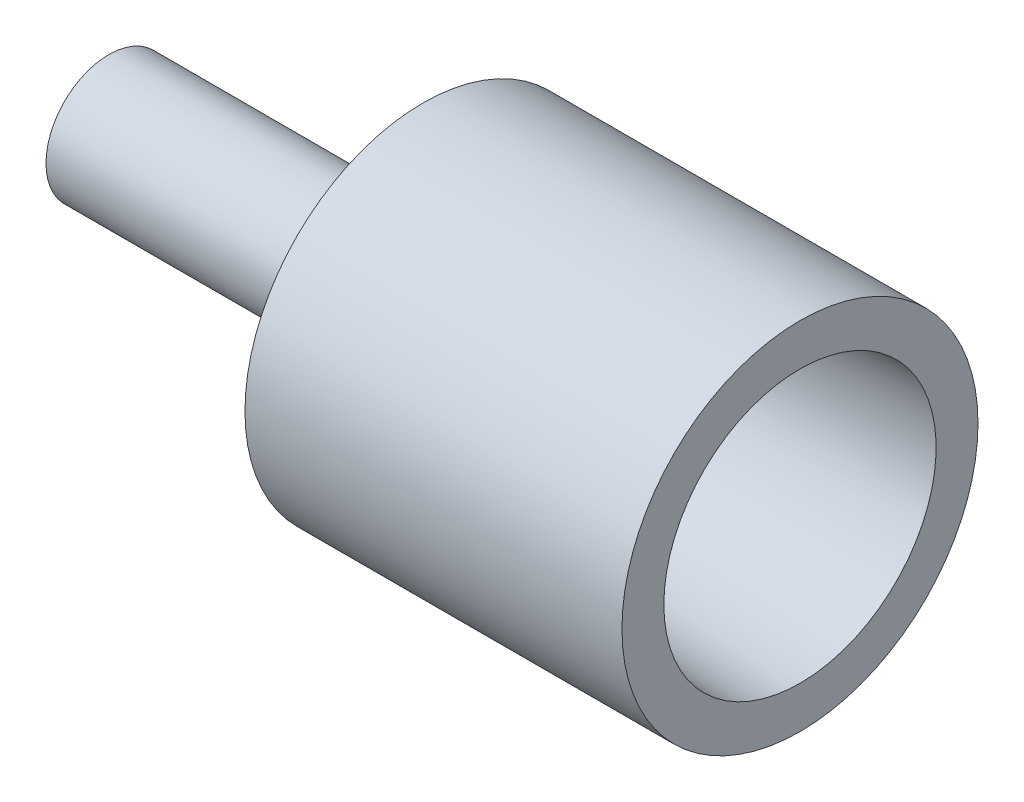
ISO-10303-21;
HEADER;
FILE_DESCRIPTION(('STEP AP214'),'2;1');
FILE_NAME('part.step','',(''),(''),'','','');
FILE_SCHEMA(('AUTOMOTIVE_DESIGN { 1 0 10303 214 1 1 1 1 }'));
ENDSEC;
DATA;
#1=APPLICATION_CONTEXT('core data for automotive mechanical design processes');
#2=APPLICATION_PROTOCOL_DEFINITION('international standard','automotive_design',2000,#1);
#3=PRODUCT_CONTEXT('',#1,'mechanical');
#4=PRODUCT('Part','Part','',(#3));
#5=PRODUCT_RELATED_PRODUCT_CATEGORY('part','',(#4));
#6=PRODUCT_DEFINITION_FORMATION('','',#4);
#7=PRODUCT_DEFINITION_CONTEXT('part definition',#1,'design');
#8=PRODUCT_DEFINITION('design','',#6,#7);
#9=PRODUCT_DEFINITION_SHAPE('','',#8);
#10=(LENGTH_UNIT() NAMED_UNIT(*) SI_UNIT(.MILLI.,.METRE.));
#11=(NAMED_UNIT(*) PLANE_ANGLE_UNIT() SI_UNIT($,.RADIAN.));
#12=(NAMED_UNIT(*) SI_UNIT($,.STERADIAN.) SOLID_ANGLE_UNIT());
#13=UNCERTAINTY_MEASURE_WITH_UNIT(LENGTH_MEASURE(1.E-05),#10,'distance_accuracy_value','');
#14=(GEOMETRIC_REPRESENTATION_CONTEXT(3) GLOBAL_UNCERTAINTY_ASSIGNED_CONTEXT((#13)) GLOBAL_UNIT_ASSIGNED_CONTEXT((#10,
#11,#12)) REPRESENTATION_CONTEXT('',''));
#15=CARTESIAN_POINT('',(0.,0.,0.));
#16=DIRECTION('',(0.,0.,1.));
#17=DIRECTION('',(1.,0.,0.));
#18=AXIS2_PLACEMENT_3D('',#15,#16,#17);
#19=CARTESIAN_POINT('',(15.,0.,-6.5));
#20=DIRECTION('',(-1.,0.,0.));
#21=DIRECTION('',(0.,0.,1.));
#22=AXIS2_PLACEMENT_3D('',#19,#20,#21);
#23=PLANE('',#22);
#24=CARTESIAN_POINT('',(15.,0.,0.));
#25=DIRECTION('',(-1.,0.,0.));
#26=DIRECTION('',(0.,0.,1.));
#27=AXIS2_PLACEMENT_3D('',#24,#25,#26);
#28=CIRCLE('',#27,8.5);
#29=CARTESIAN_POINT('',(15.,0.,8.5));
#30=VERTEX_POINT('',#29);
#31=EDGE_CURVE('E50',#30,#30,#28,.T.);
#32=ORIENTED_EDGE('',*,*,#31,.F.);
#33=EDGE_LOOP('',(#32));
#34=FACE_BOUND('',#33,.T.);
#35=CARTESIAN_POINT('',(15.,0.,0.));
#36=DIRECTION('',(-1.,0.,0.));
#37=DIRECTION('',(0.,0.,1.));
#38=AXIS2_PLACEMENT_3D('',#35,#36,#37);
#39=CIRCLE('',#38,6.5);
#40=CARTESIAN_POINT('',(15.,0.,6.5));
#41=VERTEX_POINT('',#40);
#42=EDGE_CURVE('E69',#41,#41,#39,.T.);
#43=ORIENTED_EDGE('',*,*,#42,.T.);
#44=EDGE_LOOP('',(#43));
#45=FACE_BOUND('',#44,.T.);
#46=ADVANCED_FACE('F37',(#34,#45),#23,.F.);
#47=CARTESIAN_POINT('',(-18.,0.,0.));
#48=DIRECTION('',(-1.,0.,0.));
#49=DIRECTION('',(0.,0.,1.));
#50=AXIS2_PLACEMENT_3D('',#47,#48,#49);
#51=CYLINDRICAL_SURFACE('',#50,8.5);
#52=CARTESIAN_POINT('',(-3.,0.,0.));
#53=DIRECTION('',(-1.,0.,0.));
#54=DIRECTION('',(0.,0.,1.));
#55=AXIS2_PLACEMENT_3D('',#52,#53,#54);
#56=CIRCLE('',#55,8.5);
#57=CARTESIAN_POINT('',(-3.,0.,8.5));
#58=VERTEX_POINT('',#57);
#59=EDGE_CURVE('E56',#58,#58,#56,.T.);
#60=ORIENTED_EDGE('',*,*,#59,.F.);
#61=EDGE_LOOP('',(#60));
#62=FACE_BOUND('',#61,.T.);
#63=ORIENTED_EDGE('',*,*,#31,.T.);
#64=EDGE_LOOP('',(#63));
#65=FACE_BOUND('',#64,.T.);
#66=ADVANCED_FACE('F92',(#62,#65),#51,.T.);
#67=CARTESIAN_POINT('',(-3.,0.,-8.5));
#68=DIRECTION('',(1.,0.,0.));
#69=DIRECTION('',(0.,0.,-1.));
#70=AXIS2_PLACEMENT_3D('',#67,#68,#69);
#71=PLANE('',#70);
#72=CARTESIAN_POINT('',(-3.,0.,0.));
#73=DIRECTION('',(1.,0.,0.));
#74=DIRECTION('',(0.,0.,-1.));
#75=AXIS2_PLACEMENT_3D('',#72,#73,#74);
#76=CIRCLE('',#75,5.99999999999999);
#77=CARTESIAN_POINT('',(-3.,0.,-5.99999999999999));
#78=VERTEX_POINT('',#77);
#79=EDGE_CURVE('E10',#78,#78,#76,.T.);
#80=ORIENTED_EDGE('',*,*,#79,.T.);
#81=EDGE_LOOP('',(#80));
#82=FACE_BOUND('',#81,.T.);
#83=ORIENTED_EDGE('',*,*,#59,.T.);
#84=EDGE_LOOP('',(#83));
#85=FACE_BOUND('',#84,.T.);
#86=ADVANCED_FACE('F97',(#82,#85),#71,.F.);
#87=CARTESIAN_POINT('',(-18.,0.,0.));
#88=DIRECTION('',(-1.,0.,0.));
#89=DIRECTION('',(0.,0.,1.));
#90=AXIS2_PLACEMENT_3D('',#87,#88,#89);
#91=CYLINDRICAL_SURFACE('',#90,3.);
#92=CARTESIAN_POINT('',(-6.00000000000002,0.,0.));
#93=DIRECTION('',(1.,0.,0.));
#94=DIRECTION('',(0.,0.,-1.));
#95=AXIS2_PLACEMENT_3D('',#92,#93,#94);
#96=CIRCLE('',#95,3.);
#97=CARTESIAN_POINT('',(-6.00000000000002,0.,-3.));
#98=VERTEX_POINT('',#97);
#99=EDGE_CURVE('E45',#98,#98,#96,.F.);
#100=ORIENTED_EDGE('',*,*,#99,.T.);
#101=EDGE_LOOP('',(#100));
#102=FACE_BOUND('',#101,.T.);
#103=CARTESIAN_POINT('',(-18.,0.,0.));
#104=DIRECTION('',(-1.,0.,0.));
#105=DIRECTION('',(0.,0.,1.));
#106=AXIS2_PLACEMENT_3D('',#103,#104,#105);
#107=CIRCLE('',#106,3.);
#108=CARTESIAN_POINT('',(-18.,0.,3.));
#109=VERTEX_POINT('',#108);
#110=EDGE_CURVE('E61',#109,#109,#107,.T.);
#111=ORIENTED_EDGE('',*,*,#110,.F.);
#112=EDGE_LOOP('',(#111));
#113=FACE_BOUND('',#112,.T.);
#114=ADVANCED_FACE('F88',(#102,#113),#91,.T.);
#115=CARTESIAN_POINT('',(-18.,0.,-3.));
#116=DIRECTION('',(1.,0.,0.));
#117=DIRECTION('',(0.,0.,-1.));
#118=AXIS2_PLACEMENT_3D('',#115,#116,#117);
#119=PLANE('',#118);
#120=ORIENTED_EDGE('',*,*,#110,.T.);
#121=EDGE_LOOP('',(#120));
#122=FACE_BOUND('',#121,.T.);
#123=ADVANCED_FACE('F83',(#122),#119,.F.);
#124=CARTESIAN_POINT('',(0.,0.,0.));
#125=DIRECTION('',(-1.,0.,0.));
#126=DIRECTION('',(0.,0.,1.));
#127=AXIS2_PLACEMENT_3D('',#124,#125,#126);
#128=PLANE('',#127);
#129=CARTESIAN_POINT('',(0.,0.,0.));
#130=DIRECTION('',(-1.,0.,0.));
#131=DIRECTION('',(0.,0.,1.));
#132=AXIS2_PLACEMENT_3D('',#129,#130,#131);
#133=CIRCLE('',#132,5.75);
#134=CARTESIAN_POINT('',(0.,0.,5.75));
#135=VERTEX_POINT('',#134);
#136=EDGE_CURVE('E65',#135,#135,#133,.T.);
#137=ORIENTED_EDGE('',*,*,#136,.F.);
#138=EDGE_LOOP('',(#137));
#139=FACE_BOUND('',#138,.T.);
#140=ADVANCED_FACE('F78',(#139),#128,.F.);
#141=CARTESIAN_POINT('',(0.,0.,0.));
#142=DIRECTION('',(1.,0.,0.));
#143=DIRECTION('',(0.,0.,-1.));
#144=AXIS2_PLACEMENT_3D('',#141,#142,#143);
#145=CONICAL_SURFACE('',#144,5.75,0.0499583957219427);
#146=ORIENTED_EDGE('',*,*,#42,.F.);
#147=EDGE_LOOP('',(#146));
#148=FACE_BOUND('',#147,.T.);
#149=ORIENTED_EDGE('',*,*,#136,.T.);
#150=EDGE_LOOP('',(#149));
#151=FACE_BOUND('',#150,.T.);
#152=ADVANCED_FACE('F75',(#148,#151),#145,.F.);
#153=CARTESIAN_POINT('',(-6.00000000000002,0.,0.));
#154=DIRECTION('',(1.,0.,0.));
#155=DIRECTION('',(0.,0.,-1.));
#156=AXIS2_PLACEMENT_3D('',#153,#154,#155);
#157=CONICAL_SURFACE('',#156,3.,0.785398163397444);
#158=ORIENTED_EDGE('',*,*,#79,.F.);
#159=EDGE_LOOP('',(#158));
#160=FACE_BOUND('',#159,.T.);
#161=ORIENTED_EDGE('',*,*,#99,.F.);
#162=EDGE_LOOP('',(#161));
#163=FACE_BOUND('',#162,.T.);
#164=ADVANCED_FACE('F39',(#160,#163),#157,.T.);
#165=CLOSED_SHELL('',(#46,#66,#86,#114,#123,#140,#152,#164));
#166=MANIFOLD_SOLID_BREP('B2',#165);
#167=ADVANCED_BREP_SHAPE_REPRESENTATION('',(#18,#166),#14);
#168=SHAPE_DEFINITION_REPRESENTATION(#9,#167);
ENDSEC;
END-ISO-10303-21;
